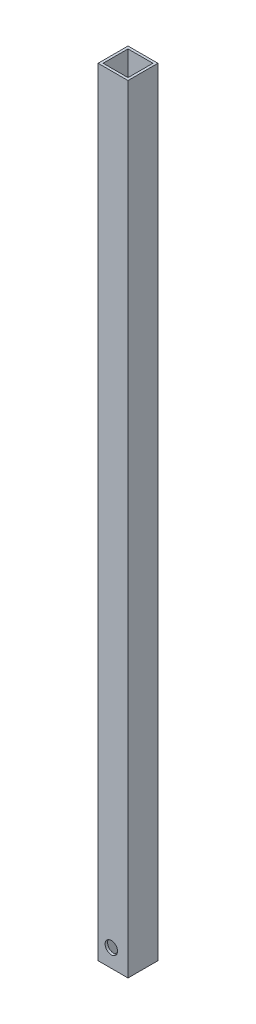
ISO-10303-21;
HEADER;
FILE_DESCRIPTION(('STEP AP214'),'2;1');
FILE_NAME('part.step','',(''),(''),'','','');
FILE_SCHEMA(('AUTOMOTIVE_DESIGN { 1 0 10303 214 1 1 1 1 }'));
ENDSEC;
DATA;
#1=APPLICATION_CONTEXT('core data for automotive mechanical design processes');
#2=APPLICATION_PROTOCOL_DEFINITION('international standard','automotive_design',2000,#1);
#3=PRODUCT_CONTEXT('',#1,'mechanical');
#4=PRODUCT('Part','Part','',(#3));
#5=PRODUCT_RELATED_PRODUCT_CATEGORY('part','',(#4));
#6=PRODUCT_DEFINITION_FORMATION('','',#4);
#7=PRODUCT_DEFINITION_CONTEXT('part definition',#1,'design');
#8=PRODUCT_DEFINITION('design','',#6,#7);
#9=PRODUCT_DEFINITION_SHAPE('','',#8);
#10=(LENGTH_UNIT() NAMED_UNIT(*) SI_UNIT(.MILLI.,.METRE.));
#11=(NAMED_UNIT(*) PLANE_ANGLE_UNIT() SI_UNIT($,.RADIAN.));
#12=(NAMED_UNIT(*) SI_UNIT($,.STERADIAN.) SOLID_ANGLE_UNIT());
#13=UNCERTAINTY_MEASURE_WITH_UNIT(LENGTH_MEASURE(1.E-05),#10,'distance_accuracy_value','');
#14=(GEOMETRIC_REPRESENTATION_CONTEXT(3) GLOBAL_UNCERTAINTY_ASSIGNED_CONTEXT((#13)) GLOBAL_UNIT_ASSIGNED_CONTEXT((#10,
#11,#12)) REPRESENTATION_CONTEXT('',''));
#15=CARTESIAN_POINT('',(0.,0.,0.));
#16=DIRECTION('',(0.,0.,1.));
#17=DIRECTION('',(1.,0.,0.));
#18=AXIS2_PLACEMENT_3D('',#15,#16,#17);
#19=CARTESIAN_POINT('',(0.,495.3,0.));
#20=DIRECTION('',(0.,1.,0.));
#21=DIRECTION('',(0.,0.,1.));
#22=AXIS2_PLACEMENT_3D('',#19,#20,#21);
#23=PLANE('',#22);
#24=DIRECTION('',(0.,0.,-1.));
#25=VECTOR('',#24,1.);
#26=CARTESIAN_POINT('',(9.525,495.3,-9.525));
#27=LINE('',#26,#25);
#28=CARTESIAN_POINT('',(9.525,495.3,9.525));
#29=VERTEX_POINT('',#28);
#30=CARTESIAN_POINT('',(9.525,495.3,-9.525));
#31=VERTEX_POINT('',#30);
#32=EDGE_CURVE('E149',#29,#31,#27,.T.);
#33=ORIENTED_EDGE('',*,*,#32,.T.);
#34=DIRECTION('',(-1.,0.,0.));
#35=VECTOR('',#34,1.);
#36=CARTESIAN_POINT('',(-9.525,495.3,-9.525));
#37=LINE('',#36,#35);
#38=CARTESIAN_POINT('',(-9.525,495.3,-9.525));
#39=VERTEX_POINT('',#38);
#40=EDGE_CURVE('E152',#31,#39,#37,.T.);
#41=ORIENTED_EDGE('',*,*,#40,.T.);
#42=DIRECTION('',(0.,0.,1.));
#43=VECTOR('',#42,1.);
#44=CARTESIAN_POINT('',(-9.525,495.3,-9.525));
#45=LINE('',#44,#43);
#46=CARTESIAN_POINT('',(-9.525,495.3,9.525));
#47=VERTEX_POINT('',#46);
#48=EDGE_CURVE('E155',#39,#47,#45,.T.);
#49=ORIENTED_EDGE('',*,*,#48,.T.);
#50=DIRECTION('',(1.,0.,0.));
#51=VECTOR('',#50,1.);
#52=CARTESIAN_POINT('',(-9.525,495.3,9.525));
#53=LINE('',#52,#51);
#54=EDGE_CURVE('E157',#47,#29,#53,.T.);
#55=ORIENTED_EDGE('',*,*,#54,.T.);
#56=EDGE_LOOP('',(#33,#41,#49,#55));
#57=FACE_BOUND('',#56,.T.);
#58=DIRECTION('',(0.,0.,1.));
#59=VECTOR('',#58,1.);
#60=CARTESIAN_POINT('',(-7.9375,495.3,-7.9375));
#61=LINE('',#60,#59);
#62=CARTESIAN_POINT('',(-7.9375,495.3,-7.9375));
#63=VERTEX_POINT('',#62);
#64=CARTESIAN_POINT('',(-7.9375,495.3,7.9375));
#65=VERTEX_POINT('',#64);
#66=EDGE_CURVE('E119',#63,#65,#61,.T.);
#67=ORIENTED_EDGE('',*,*,#66,.F.);
#68=DIRECTION('',(-1.,0.,0.));
#69=VECTOR('',#68,1.);
#70=CARTESIAN_POINT('',(-7.9375,495.3,-7.9375));
#71=LINE('',#70,#69);
#72=CARTESIAN_POINT('',(7.9375,495.3,-7.9375));
#73=VERTEX_POINT('',#72);
#74=EDGE_CURVE('E111',#73,#63,#71,.T.);
#75=ORIENTED_EDGE('',*,*,#74,.F.);
#76=DIRECTION('',(0.,0.,-1.));
#77=VECTOR('',#76,1.);
#78=CARTESIAN_POINT('',(7.9375,495.3,-7.9375));
#79=LINE('',#78,#77);
#80=CARTESIAN_POINT('',(7.9375,495.3,7.9375));
#81=VERTEX_POINT('',#80);
#82=EDGE_CURVE('E133',#81,#73,#79,.T.);
#83=ORIENTED_EDGE('',*,*,#82,.F.);
#84=DIRECTION('',(1.,0.,0.));
#85=VECTOR('',#84,1.);
#86=CARTESIAN_POINT('',(-7.9375,495.3,7.9375));
#87=LINE('',#86,#85);
#88=EDGE_CURVE('E131',#65,#81,#87,.T.);
#89=ORIENTED_EDGE('',*,*,#88,.F.);
#90=EDGE_LOOP('',(#67,#75,#83,#89));
#91=FACE_BOUND('',#90,.T.);
#92=ADVANCED_FACE('F46',(#57,#91),#23,.T.);
#93=CARTESIAN_POINT('',(0.,0.,0.));
#94=DIRECTION('',(0.,1.,0.));
#95=DIRECTION('',(0.,0.,1.));
#96=AXIS2_PLACEMENT_3D('',#93,#94,#95);
#97=PLANE('',#96);
#98=DIRECTION('',(0.,0.,-1.));
#99=VECTOR('',#98,1.);
#100=CARTESIAN_POINT('',(9.525,0.,-9.525));
#101=LINE('',#100,#99);
#102=CARTESIAN_POINT('',(9.525,0.,9.525));
#103=VERTEX_POINT('',#102);
#104=CARTESIAN_POINT('',(9.525,0.,-9.525));
#105=VERTEX_POINT('',#104);
#106=EDGE_CURVE('E127',#103,#105,#101,.T.);
#107=ORIENTED_EDGE('',*,*,#106,.F.);
#108=DIRECTION('',(1.,0.,0.));
#109=VECTOR('',#108,1.);
#110=CARTESIAN_POINT('',(-9.525,0.,9.525));
#111=LINE('',#110,#109);
#112=CARTESIAN_POINT('',(-9.525,0.,9.525));
#113=VERTEX_POINT('',#112);
#114=EDGE_CURVE('E153',#113,#103,#111,.T.);
#115=ORIENTED_EDGE('',*,*,#114,.F.);
#116=DIRECTION('',(0.,0.,1.));
#117=VECTOR('',#116,1.);
#118=CARTESIAN_POINT('',(-9.525,0.,-9.525));
#119=LINE('',#118,#117);
#120=CARTESIAN_POINT('',(-9.525,0.,-9.525));
#121=VERTEX_POINT('',#120);
#122=EDGE_CURVE('E164',#121,#113,#119,.T.);
#123=ORIENTED_EDGE('',*,*,#122,.F.);
#124=DIRECTION('',(-1.,0.,0.));
#125=VECTOR('',#124,1.);
#126=CARTESIAN_POINT('',(-9.525,0.,-9.525));
#127=LINE('',#126,#125);
#128=EDGE_CURVE('E162',#105,#121,#127,.T.);
#129=ORIENTED_EDGE('',*,*,#128,.F.);
#130=EDGE_LOOP('',(#107,#115,#123,#129));
#131=FACE_BOUND('',#130,.T.);
#132=DIRECTION('',(-1.,0.,0.));
#133=VECTOR('',#132,1.);
#134=CARTESIAN_POINT('',(-7.9375,0.,-7.9375));
#135=LINE('',#134,#133);
#136=CARTESIAN_POINT('',(7.9375,0.,-7.9375));
#137=VERTEX_POINT('',#136);
#138=CARTESIAN_POINT('',(-7.9375,0.,-7.9375));
#139=VERTEX_POINT('',#138);
#140=EDGE_CURVE('E69',#137,#139,#135,.T.);
#141=ORIENTED_EDGE('',*,*,#140,.T.);
#142=DIRECTION('',(0.,0.,1.));
#143=VECTOR('',#142,1.);
#144=CARTESIAN_POINT('',(-7.9375,0.,-7.9375));
#145=LINE('',#144,#143);
#146=CARTESIAN_POINT('',(-7.9375,0.,7.9375));
#147=VERTEX_POINT('',#146);
#148=EDGE_CURVE('E126',#139,#147,#145,.T.);
#149=ORIENTED_EDGE('',*,*,#148,.T.);
#150=DIRECTION('',(1.,0.,0.));
#151=VECTOR('',#150,1.);
#152=CARTESIAN_POINT('',(-7.9375,0.,7.9375));
#153=LINE('',#152,#151);
#154=CARTESIAN_POINT('',(7.9375,0.,7.9375));
#155=VERTEX_POINT('',#154);
#156=EDGE_CURVE('E141',#147,#155,#153,.T.);
#157=ORIENTED_EDGE('',*,*,#156,.T.);
#158=DIRECTION('',(0.,0.,-1.));
#159=VECTOR('',#158,1.);
#160=CARTESIAN_POINT('',(7.9375,0.,-7.9375));
#161=LINE('',#160,#159);
#162=EDGE_CURVE('E120',#155,#137,#161,.T.);
#163=ORIENTED_EDGE('',*,*,#162,.T.);
#164=EDGE_LOOP('',(#141,#149,#157,#163));
#165=FACE_BOUND('',#164,.T.);
#166=ADVANCED_FACE('F182',(#131,#165),#97,.F.);
#167=CARTESIAN_POINT('',(9.525,495.3,-9.525));
#168=DIRECTION('',(-1.,0.,0.));
#169=DIRECTION('',(0.,0.,1.));
#170=AXIS2_PLACEMENT_3D('',#167,#168,#169);
#171=PLANE('',#170);
#172=ORIENTED_EDGE('',*,*,#106,.T.);
#173=DIRECTION('',(0.,-1.,0.));
#174=VECTOR('',#173,1.);
#175=CARTESIAN_POINT('',(9.525,495.3,-9.525));
#176=LINE('',#175,#174);
#177=EDGE_CURVE('E13',#31,#105,#176,.T.);
#178=ORIENTED_EDGE('',*,*,#177,.F.);
#179=ORIENTED_EDGE('',*,*,#32,.F.);
#180=DIRECTION('',(0.,-1.,0.));
#181=VECTOR('',#180,1.);
#182=CARTESIAN_POINT('',(9.525,495.3,9.525));
#183=LINE('',#182,#181);
#184=EDGE_CURVE('E159',#29,#103,#183,.T.);
#185=ORIENTED_EDGE('',*,*,#184,.T.);
#186=EDGE_LOOP('',(#172,#178,#179,#185));
#187=FACE_BOUND('',#186,.T.);
#188=ADVANCED_FACE('F48',(#187),#171,.F.);
#189=CARTESIAN_POINT('',(-9.525,495.3,-9.525));
#190=DIRECTION('',(0.,0.,1.));
#191=DIRECTION('',(1.,0.,0.));
#192=AXIS2_PLACEMENT_3D('',#189,#190,#191);
#193=PLANE('',#192);
#194=ORIENTED_EDGE('',*,*,#128,.T.);
#195=DIRECTION('',(0.,-1.,0.));
#196=VECTOR('',#195,1.);
#197=CARTESIAN_POINT('',(-9.525,495.3,-9.525));
#198=LINE('',#197,#196);
#199=EDGE_CURVE('E54',#39,#121,#198,.T.);
#200=ORIENTED_EDGE('',*,*,#199,.F.);
#201=ORIENTED_EDGE('',*,*,#40,.F.);
#202=ORIENTED_EDGE('',*,*,#177,.T.);
#203=EDGE_LOOP('',(#194,#200,#201,#202));
#204=FACE_BOUND('',#203,.T.);
#205=ADVANCED_FACE('F192',(#204),#193,.F.);
#206=CARTESIAN_POINT('',(-9.525,495.3,-9.525));
#207=DIRECTION('',(1.,0.,0.));
#208=DIRECTION('',(0.,0.,-1.));
#209=AXIS2_PLACEMENT_3D('',#206,#207,#208);
#210=PLANE('',#209);
#211=CARTESIAN_POINT('',(-9.525,9.525,0.));
#212=DIRECTION('',(-1.,0.,0.));
#213=DIRECTION('',(0.,0.,1.));
#214=AXIS2_PLACEMENT_3D('',#211,#212,#213);
#215=CIRCLE('',#214,0.889);
#216=CARTESIAN_POINT('',(-9.525,9.525,0.889000000000001));
#217=VERTEX_POINT('',#216);
#218=EDGE_CURVE('E219',#217,#217,#215,.T.);
#219=ORIENTED_EDGE('',*,*,#218,.F.);
#220=EDGE_LOOP('',(#219));
#221=FACE_BOUND('',#220,.T.);
#222=ORIENTED_EDGE('',*,*,#122,.T.);
#223=DIRECTION('',(0.,-1.,0.));
#224=VECTOR('',#223,1.);
#225=CARTESIAN_POINT('',(-9.525,495.3,9.525));
#226=LINE('',#225,#224);
#227=EDGE_CURVE('E169',#47,#113,#226,.T.);
#228=ORIENTED_EDGE('',*,*,#227,.F.);
#229=ORIENTED_EDGE('',*,*,#48,.F.);
#230=ORIENTED_EDGE('',*,*,#199,.T.);
#231=EDGE_LOOP('',(#222,#228,#229,#230));
#232=FACE_BOUND('',#231,.T.);
#233=ADVANCED_FACE('F176',(#221,#232),#210,.F.);
#234=CARTESIAN_POINT('',(-9.525,495.3,9.525));
#235=DIRECTION('',(0.,0.,-1.));
#236=DIRECTION('',(-1.,0.,0.));
#237=AXIS2_PLACEMENT_3D('',#234,#235,#236);
#238=PLANE('',#237);
#239=CARTESIAN_POINT('',(-1.09537499999959,11.4523012,9.525));
#240=DIRECTION('',(0.,0.,1.));
#241=DIRECTION('',(1.,0.,0.));
#242=AXIS2_PLACEMENT_3D('',#239,#240,#241);
#243=CIRCLE('',#242,3.96875000000002);
#244=CARTESIAN_POINT('',(2.87337500000043,11.4523012,9.525));
#245=VERTEX_POINT('',#244);
#246=EDGE_CURVE('E217',#245,#245,#243,.T.);
#247=ORIENTED_EDGE('',*,*,#246,.F.);
#248=EDGE_LOOP('',(#247));
#249=FACE_BOUND('',#248,.T.);
#250=ORIENTED_EDGE('',*,*,#114,.T.);
#251=ORIENTED_EDGE('',*,*,#184,.F.);
#252=ORIENTED_EDGE('',*,*,#54,.F.);
#253=ORIENTED_EDGE('',*,*,#227,.T.);
#254=EDGE_LOOP('',(#250,#251,#252,#253));
#255=FACE_BOUND('',#254,.T.);
#256=ADVANCED_FACE('F186',(#249,#255),#238,.F.);
#257=CARTESIAN_POINT('',(-7.9375,495.3,-7.9375));
#258=DIRECTION('',(0.,0.,1.));
#259=DIRECTION('',(1.,0.,0.));
#260=AXIS2_PLACEMENT_3D('',#257,#258,#259);
#261=PLANE('',#260);
#262=ORIENTED_EDGE('',*,*,#140,.F.);
#263=DIRECTION('',(0.,-1.,0.));
#264=VECTOR('',#263,1.);
#265=CARTESIAN_POINT('',(7.9375,495.3,-7.9375));
#266=LINE('',#265,#264);
#267=EDGE_CURVE('E115',#73,#137,#266,.T.);
#268=ORIENTED_EDGE('',*,*,#267,.F.);
#269=ORIENTED_EDGE('',*,*,#74,.T.);
#270=DIRECTION('',(0.,-1.,0.));
#271=VECTOR('',#270,1.);
#272=CARTESIAN_POINT('',(-7.9375,495.3,-7.9375));
#273=LINE('',#272,#271);
#274=EDGE_CURVE('E114',#63,#139,#273,.T.);
#275=ORIENTED_EDGE('',*,*,#274,.T.);
#276=EDGE_LOOP('',(#262,#268,#269,#275));
#277=FACE_BOUND('',#276,.T.);
#278=ADVANCED_FACE('F113',(#277),#261,.T.);
#279=CARTESIAN_POINT('',(-7.9375,495.3,-7.9375));
#280=DIRECTION('',(1.,0.,0.));
#281=DIRECTION('',(0.,0.,-1.));
#282=AXIS2_PLACEMENT_3D('',#279,#280,#281);
#283=PLANE('',#282);
#284=CARTESIAN_POINT('',(-7.9375,9.525,0.));
#285=DIRECTION('',(1.,0.,0.));
#286=DIRECTION('',(0.,0.,-1.));
#287=AXIS2_PLACEMENT_3D('',#284,#285,#286);
#288=CIRCLE('',#287,0.889);
#289=CARTESIAN_POINT('',(-7.9375,9.525,-0.888999999999998));
#290=VERTEX_POINT('',#289);
#291=EDGE_CURVE('E223',#290,#290,#288,.F.);
#292=ORIENTED_EDGE('',*,*,#291,.T.);
#293=EDGE_LOOP('',(#292));
#294=FACE_BOUND('',#293,.T.);
#295=ORIENTED_EDGE('',*,*,#148,.F.);
#296=ORIENTED_EDGE('',*,*,#274,.F.);
#297=ORIENTED_EDGE('',*,*,#66,.T.);
#298=DIRECTION('',(0.,-1.,0.));
#299=VECTOR('',#298,1.);
#300=CARTESIAN_POINT('',(-7.9375,495.3,7.9375));
#301=LINE('',#300,#299);
#302=EDGE_CURVE('E128',#65,#147,#301,.T.);
#303=ORIENTED_EDGE('',*,*,#302,.T.);
#304=EDGE_LOOP('',(#295,#296,#297,#303));
#305=FACE_BOUND('',#304,.T.);
#306=ADVANCED_FACE('F123',(#294,#305),#283,.T.);
#307=CARTESIAN_POINT('',(-7.9375,495.3,7.9375));
#308=DIRECTION('',(0.,0.,-1.));
#309=DIRECTION('',(-1.,0.,0.));
#310=AXIS2_PLACEMENT_3D('',#307,#308,#309);
#311=PLANE('',#310);
#312=CARTESIAN_POINT('',(-1.09537499999959,11.4523012,7.9375));
#313=DIRECTION('',(0.,0.,-1.));
#314=DIRECTION('',(-1.,0.,0.));
#315=AXIS2_PLACEMENT_3D('',#312,#313,#314);
#316=CIRCLE('',#315,3.96875000000002);
#317=CARTESIAN_POINT('',(-5.06412499999961,11.4523012,7.9375));
#318=VERTEX_POINT('',#317);
#319=EDGE_CURVE('E139',#318,#318,#316,.F.);
#320=ORIENTED_EDGE('',*,*,#319,.T.);
#321=EDGE_LOOP('',(#320));
#322=FACE_BOUND('',#321,.T.);
#323=ORIENTED_EDGE('',*,*,#156,.F.);
#324=ORIENTED_EDGE('',*,*,#302,.F.);
#325=ORIENTED_EDGE('',*,*,#88,.T.);
#326=DIRECTION('',(0.,-1.,0.));
#327=VECTOR('',#326,1.);
#328=CARTESIAN_POINT('',(7.9375,495.3,7.9375));
#329=LINE('',#328,#327);
#330=EDGE_CURVE('E61',#81,#155,#329,.T.);
#331=ORIENTED_EDGE('',*,*,#330,.T.);
#332=EDGE_LOOP('',(#323,#324,#325,#331));
#333=FACE_BOUND('',#332,.T.);
#334=ADVANCED_FACE('F244',(#322,#333),#311,.T.);
#335=CARTESIAN_POINT('',(7.9375,495.3,-7.9375));
#336=DIRECTION('',(-1.,0.,0.));
#337=DIRECTION('',(0.,0.,1.));
#338=AXIS2_PLACEMENT_3D('',#335,#336,#337);
#339=PLANE('',#338);
#340=ORIENTED_EDGE('',*,*,#162,.F.);
#341=ORIENTED_EDGE('',*,*,#330,.F.);
#342=ORIENTED_EDGE('',*,*,#82,.T.);
#343=ORIENTED_EDGE('',*,*,#267,.T.);
#344=EDGE_LOOP('',(#340,#341,#342,#343));
#345=FACE_BOUND('',#344,.T.);
#346=ADVANCED_FACE('F239',(#345),#339,.T.);
#347=CARTESIAN_POINT('',(-1.09537499999959,11.4523012,-3.28782015133649));
#348=DIRECTION('',(0.,0.,1.));
#349=DIRECTION('',(1.,0.,0.));
#350=AXIS2_PLACEMENT_3D('',#347,#348,#349);
#351=CYLINDRICAL_SURFACE('',#350,3.96875000000002);
#352=ORIENTED_EDGE('',*,*,#246,.T.);
#353=EDGE_LOOP('',(#352));
#354=FACE_BOUND('',#353,.T.);
#355=ORIENTED_EDGE('',*,*,#319,.F.);
#356=EDGE_LOOP('',(#355));
#357=FACE_BOUND('',#356,.T.);
#358=ADVANCED_FACE('F233',(#354,#357),#351,.F.);
#359=CARTESIAN_POINT('',(9.52600000000001,9.525,0.));
#360=DIRECTION('',(-1.,0.,0.));
#361=DIRECTION('',(0.,0.,1.));
#362=AXIS2_PLACEMENT_3D('',#359,#360,#361);
#363=CYLINDRICAL_SURFACE('',#362,0.889);
#364=ORIENTED_EDGE('',*,*,#291,.F.);
#365=EDGE_LOOP('',(#364));
#366=FACE_BOUND('',#365,.T.);
#367=ORIENTED_EDGE('',*,*,#218,.T.);
#368=EDGE_LOOP('',(#367));
#369=FACE_BOUND('',#368,.T.);
#370=ADVANCED_FACE('F230',(#366,#369),#363,.F.);
#371=CLOSED_SHELL('',(#92,#166,#188,#205,#233,#256,#278,#306,#334,#346,#358,#370));
#372=MANIFOLD_SOLID_BREP('B2',#371);
#373=ADVANCED_BREP_SHAPE_REPRESENTATION('',(#18,#372),#14);
#374=SHAPE_DEFINITION_REPRESENTATION(#9,#373);
ENDSEC;
END-ISO-10303-21;
